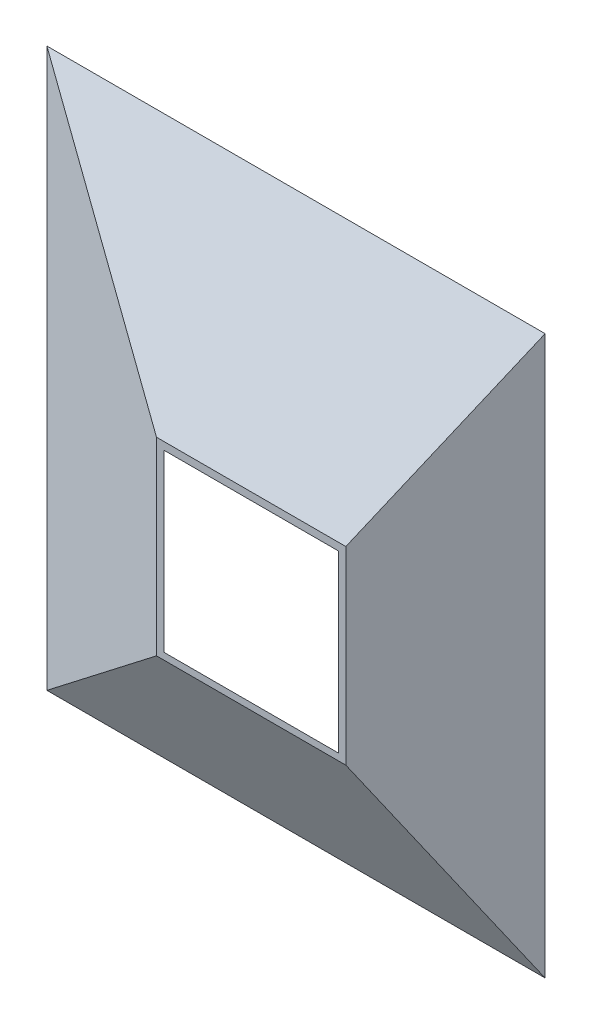
ISO-10303-21;
HEADER;
FILE_DESCRIPTION(('STEP AP214'),'2;1');
FILE_NAME('part.step','',(''),(''),'','','');
FILE_SCHEMA(('AUTOMOTIVE_DESIGN { 1 0 10303 214 1 1 1 1 }'));
ENDSEC;
DATA;
#1=APPLICATION_CONTEXT('core data for automotive mechanical design processes');
#2=APPLICATION_PROTOCOL_DEFINITION('international standard','automotive_design',2000,#1);
#3=PRODUCT_CONTEXT('',#1,'mechanical');
#4=PRODUCT('Part','Part','',(#3));
#5=PRODUCT_RELATED_PRODUCT_CATEGORY('part','',(#4));
#6=PRODUCT_DEFINITION_FORMATION('','',#4);
#7=PRODUCT_DEFINITION_CONTEXT('part definition',#1,'design');
#8=PRODUCT_DEFINITION('design','',#6,#7);
#9=PRODUCT_DEFINITION_SHAPE('','',#8);
#10=(LENGTH_UNIT() NAMED_UNIT(*) SI_UNIT(.MILLI.,.METRE.));
#11=(NAMED_UNIT(*) PLANE_ANGLE_UNIT() SI_UNIT($,.RADIAN.));
#12=(NAMED_UNIT(*) SI_UNIT($,.STERADIAN.) SOLID_ANGLE_UNIT());
#13=UNCERTAINTY_MEASURE_WITH_UNIT(LENGTH_MEASURE(1.E-05),#10,'distance_accuracy_value','');
#14=(GEOMETRIC_REPRESENTATION_CONTEXT(3) GLOBAL_UNCERTAINTY_ASSIGNED_CONTEXT((#13)) GLOBAL_UNIT_ASSIGNED_CONTEXT((#10,
#11,#12)) REPRESENTATION_CONTEXT('',''));
#15=CARTESIAN_POINT('',(0.,0.,0.));
#16=DIRECTION('',(0.,0.,1.));
#17=DIRECTION('',(1.,0.,0.));
#18=AXIS2_PLACEMENT_3D('',#15,#16,#17);
#19=CARTESIAN_POINT('',(0.,0.,100.));
#20=DIRECTION('',(0.,0.,-1.));
#21=DIRECTION('',(-1.,0.,0.));
#22=AXIS2_PLACEMENT_3D('',#19,#20,#21);
#23=PLANE('',#22);
#24=DIRECTION('',(0.,-1.,0.));
#25=VECTOR('',#24,1.);
#26=CARTESIAN_POINT('',(-40.,280.,100.));
#27=LINE('',#26,#25);
#28=CARTESIAN_POINT('',(-39.9999999999999,95.,100.));
#29=VERTEX_POINT('',#28);
#30=CARTESIAN_POINT('',(-40.,-94.9999999999999,100.));
#31=VERTEX_POINT('',#30);
#32=EDGE_CURVE('E200',#29,#31,#27,.T.);
#33=ORIENTED_EDGE('',*,*,#32,.T.);
#34=DIRECTION('',(-1.,0.,0.));
#35=VECTOR('',#34,1.);
#36=CARTESIAN_POINT('',(310.,-95.,100.));
#37=LINE('',#36,#35);
#38=CARTESIAN_POINT('',(150.,-95.,100.));
#39=VERTEX_POINT('',#38);
#40=EDGE_CURVE('E338',#39,#31,#37,.T.);
#41=ORIENTED_EDGE('',*,*,#40,.F.);
#42=DIRECTION('',(0.,1.,0.));
#43=VECTOR('',#42,1.);
#44=CARTESIAN_POINT('',(150.,-280.,100.));
#45=LINE('',#44,#43);
#46=CARTESIAN_POINT('',(150.,95.,100.));
#47=VERTEX_POINT('',#46);
#48=EDGE_CURVE('E348',#39,#47,#45,.T.);
#49=ORIENTED_EDGE('',*,*,#48,.T.);
#50=DIRECTION('',(-1.,0.,0.));
#51=VECTOR('',#50,1.);
#52=CARTESIAN_POINT('',(310.,95.,100.));
#53=LINE('',#52,#51);
#54=EDGE_CURVE('E343',#47,#29,#53,.T.);
#55=ORIENTED_EDGE('',*,*,#54,.T.);
#56=EDGE_LOOP('',(#33,#41,#49,#55));
#57=FACE_BOUND('',#56,.T.);
#58=DIRECTION('',(-1.,0.,0.));
#59=VECTOR('',#58,1.);
#60=CARTESIAN_POINT('',(142.44134744102,87.4212328739052,100.));
#61=LINE('',#60,#59);
#62=CARTESIAN_POINT('',(142.44134744102,87.4212328739052,100.));
#63=VERTEX_POINT('',#62);
#64=CARTESIAN_POINT('',(-32.4199058178358,87.4212328739052,100.));
#65=VERTEX_POINT('',#64);
#66=EDGE_CURVE('E120',#63,#65,#61,.T.);
#67=ORIENTED_EDGE('',*,*,#66,.F.);
#68=DIRECTION('',(0.,1.,0.));
#69=VECTOR('',#68,1.);
#70=CARTESIAN_POINT('',(142.44134744102,87.4212328739052,100.));
#71=LINE('',#70,#69);
#72=CARTESIAN_POINT('',(142.44134744102,-88.1825310144982,100.));
#73=VERTEX_POINT('',#72);
#74=EDGE_CURVE('E192',#73,#63,#71,.T.);
#75=ORIENTED_EDGE('',*,*,#74,.F.);
#76=DIRECTION('',(1.,0.,0.));
#77=VECTOR('',#76,1.);
#78=CARTESIAN_POINT('',(142.44134744102,-88.1825310144982,100.));
#79=LINE('',#78,#77);
#80=CARTESIAN_POINT('',(-32.4199058178358,-88.1825310144982,100.));
#81=VERTEX_POINT('',#80);
#82=EDGE_CURVE('E158',#81,#73,#79,.T.);
#83=ORIENTED_EDGE('',*,*,#82,.F.);
#84=DIRECTION('',(0.,-1.,0.));
#85=VECTOR('',#84,1.);
#86=CARTESIAN_POINT('',(-32.4199058178358,87.4212328739052,100.));
#87=LINE('',#86,#85);
#88=EDGE_CURVE('E51',#65,#81,#87,.T.);
#89=ORIENTED_EDGE('',*,*,#88,.F.);
#90=EDGE_LOOP('',(#67,#75,#83,#89));
#91=FACE_BOUND('',#90,.T.);
#92=ADVANCED_FACE('F46',(#57,#91),#23,.F.);
#93=CARTESIAN_POINT('',(0.,0.,0.));
#94=DIRECTION('',(0.,0.,-1.));
#95=DIRECTION('',(-1.,0.,0.));
#96=AXIS2_PLACEMENT_3D('',#93,#94,#95);
#97=PLANE('',#96);
#98=DIRECTION('',(0.,1.,0.));
#99=VECTOR('',#98,1.);
#100=CARTESIAN_POINT('',(250.,-280.,0.));
#101=LINE('',#100,#99);
#102=CARTESIAN_POINT('',(250.,-280.,0.));
#103=VERTEX_POINT('',#102);
#104=CARTESIAN_POINT('',(250.,280.,0.));
#105=VERTEX_POINT('',#104);
#106=EDGE_CURVE('E352',#103,#105,#101,.T.);
#107=ORIENTED_EDGE('',*,*,#106,.F.);
#108=DIRECTION('',(1.,0.,0.));
#109=VECTOR('',#108,1.);
#110=CARTESIAN_POINT('',(-250.,-280.,0.));
#111=LINE('',#110,#109);
#112=CARTESIAN_POINT('',(-250.,-280.,0.));
#113=VERTEX_POINT('',#112);
#114=EDGE_CURVE('E359',#113,#103,#111,.T.);
#115=ORIENTED_EDGE('',*,*,#114,.F.);
#116=DIRECTION('',(0.,-1.,0.));
#117=VECTOR('',#116,1.);
#118=CARTESIAN_POINT('',(-250.,-280.,0.));
#119=LINE('',#118,#117);
#120=CARTESIAN_POINT('',(-250.,280.,0.));
#121=VERTEX_POINT('',#120);
#122=EDGE_CURVE('E334',#121,#113,#119,.T.);
#123=ORIENTED_EDGE('',*,*,#122,.F.);
#124=DIRECTION('',(-1.,0.,0.));
#125=VECTOR('',#124,1.);
#126=CARTESIAN_POINT('',(-250.,280.,0.));
#127=LINE('',#126,#125);
#128=EDGE_CURVE('E355',#105,#121,#127,.T.);
#129=ORIENTED_EDGE('',*,*,#128,.F.);
#130=EDGE_LOOP('',(#107,#115,#123,#129));
#131=FACE_BOUND('',#130,.T.);
#132=DIRECTION('',(0.,-1.,0.));
#133=VECTOR('',#132,1.);
#134=CARTESIAN_POINT('',(241.18884501592,269.660255485912,0.));
#135=LINE('',#134,#133);
#136=CARTESIAN_POINT('',(241.18884501592,269.660255485912,0.));
#137=VERTEX_POINT('',#136);
#138=CARTESIAN_POINT('',(241.18884501592,-264.424134020165,0.));
#139=VERTEX_POINT('',#138);
#140=EDGE_CURVE('E139',#137,#139,#135,.T.);
#141=ORIENTED_EDGE('',*,*,#140,.F.);
#142=DIRECTION('',(1.,0.,0.));
#143=VECTOR('',#142,1.);
#144=CARTESIAN_POINT('',(-235.298208366956,269.660255485912,0.));
#145=LINE('',#144,#143);
#146=CARTESIAN_POINT('',(-235.298208366956,269.660255485912,0.));
#147=VERTEX_POINT('',#146);
#148=EDGE_CURVE('E116',#147,#137,#145,.T.);
#149=ORIENTED_EDGE('',*,*,#148,.F.);
#150=DIRECTION('',(0.,1.,0.));
#151=VECTOR('',#150,1.);
#152=CARTESIAN_POINT('',(-235.298208366956,269.660255485912,0.));
#153=LINE('',#152,#151);
#154=CARTESIAN_POINT('',(-235.298208366956,-264.424134020165,0.));
#155=VERTEX_POINT('',#154);
#156=EDGE_CURVE('E127',#155,#147,#153,.T.);
#157=ORIENTED_EDGE('',*,*,#156,.F.);
#158=DIRECTION('',(-1.,0.,0.));
#159=VECTOR('',#158,1.);
#160=CARTESIAN_POINT('',(-235.298208366956,-264.424134020165,0.));
#161=LINE('',#160,#159);
#162=EDGE_CURVE('E133',#139,#155,#161,.T.);
#163=ORIENTED_EDGE('',*,*,#162,.F.);
#164=EDGE_LOOP('',(#141,#149,#157,#163));
#165=FACE_BOUND('',#164,.T.);
#166=ADVANCED_FACE('F48',(#131,#165),#97,.T.);
#167=CARTESIAN_POINT('',(310.,-95.,100.));
#168=DIRECTION('',(0.,0.475517034365474,-0.879706513576127));
#169=DIRECTION('',(0.,0.879706513576127,0.475517034365474));
#170=AXIS2_PLACEMENT_3D('',#167,#168,#169);
#171=PLANE('',#170);
#172=DIRECTION('',(0.706606245425384,0.622486454303314,0.336479164488278));
#173=VECTOR('',#172,1.);
#174=CARTESIAN_POINT('',(134.752335125955,58.9484857061987,183.215397679026));
#175=LINE('',#174,#173);
#176=EDGE_CURVE('E202',#113,#31,#175,.T.);
#177=ORIENTED_EDGE('',*,*,#176,.F.);
#178=ORIENTED_EDGE('',*,*,#114,.T.);
#179=DIRECTION('',(0.429437750933887,-0.794459839227691,-0.429437750933887));
#180=VECTOR('',#179,1.);
#181=CARTESIAN_POINT('',(213.116643614569,-211.765790686953,36.8833563854311));
#182=LINE('',#181,#180);
#183=EDGE_CURVE('E346',#39,#103,#182,.T.);
#184=ORIENTED_EDGE('',*,*,#183,.F.);
#185=ORIENTED_EDGE('',*,*,#40,.T.);
#186=EDGE_LOOP('',(#177,#178,#184,#185));
#187=FACE_BOUND('',#186,.T.);
#188=ADVANCED_FACE('F344',(#187),#171,.F.);
#189=CARTESIAN_POINT('',(310.,95.,100.));
#190=DIRECTION('',(0.,-0.475517034365474,-0.879706513576127));
#191=DIRECTION('',(0.,0.879706513576127,-0.475517034365474));
#192=AXIS2_PLACEMENT_3D('',#189,#190,#191);
#193=PLANE('',#192);
#194=DIRECTION('',(-0.706606245425384,0.622486454303314,-0.336479164488278));
#195=VECTOR('',#194,1.);
#196=CARTESIAN_POINT('',(134.752335125955,-58.9484857061987,183.215397679026));
#197=LINE('',#196,#195);
#198=EDGE_CURVE('E12',#29,#121,#197,.T.);
#199=ORIENTED_EDGE('',*,*,#198,.F.);
#200=ORIENTED_EDGE('',*,*,#54,.F.);
#201=DIRECTION('',(-0.429437750933887,-0.794459839227691,0.429437750933887));
#202=VECTOR('',#201,1.);
#203=CARTESIAN_POINT('',(22.060857538036,-141.687413554633,227.939142461964));
#204=LINE('',#203,#202);
#205=EDGE_CURVE('E57',#105,#47,#204,.T.);
#206=ORIENTED_EDGE('',*,*,#205,.F.);
#207=ORIENTED_EDGE('',*,*,#128,.T.);
#208=EDGE_LOOP('',(#199,#200,#206,#207));
#209=FACE_BOUND('',#208,.T.);
#210=ADVANCED_FACE('F329',(#209),#193,.F.);
#211=CARTESIAN_POINT('',(150.,-280.,100.));
#212=DIRECTION('',(-0.707106781186548,0.,-0.707106781186548));
#213=DIRECTION('',(-0.707106781186548,0.,0.707106781186548));
#214=AXIS2_PLACEMENT_3D('',#211,#212,#213);
#215=PLANE('',#214);
#216=ORIENTED_EDGE('',*,*,#106,.T.);
#217=ORIENTED_EDGE('',*,*,#205,.T.);
#218=ORIENTED_EDGE('',*,*,#48,.F.);
#219=ORIENTED_EDGE('',*,*,#183,.T.);
#220=EDGE_LOOP('',(#216,#217,#218,#219));
#221=FACE_BOUND('',#220,.T.);
#222=ADVANCED_FACE('F172',(#221),#215,.F.);
#223=CARTESIAN_POINT('',(-40.,280.,100.));
#224=DIRECTION('',(-0.429933580392348,0.,0.90286051882393));
#225=DIRECTION('',(0.90286051882393,0.,0.429933580392348));
#226=AXIS2_PLACEMENT_3D('',#223,#224,#225);
#227=PLANE('',#226);
#228=ORIENTED_EDGE('',*,*,#176,.T.);
#229=ORIENTED_EDGE('',*,*,#32,.F.);
#230=ORIENTED_EDGE('',*,*,#198,.T.);
#231=ORIENTED_EDGE('',*,*,#122,.T.);
#232=EDGE_LOOP('',(#228,#229,#230,#231));
#233=FACE_BOUND('',#232,.T.);
#234=ADVANCED_FACE('F247',(#233),#227,.T.);
#235=CARTESIAN_POINT('',(0.,62.4053765361654,113.72694825685));
#236=DIRECTION('',(0.,-0.481063640079715,-0.876685675823014));
#237=DIRECTION('',(0.,0.876685675823014,-0.481063640079715));
#238=AXIS2_PLACEMENT_3D('',#235,#236,#237);
#239=PLANE('',#238);
#240=DIRECTION('',(0.69845730080494,-0.627401620752886,0.344274026364072));
#241=VECTOR('',#240,1.);
#242=CARTESIAN_POINT('',(-235.298208366956,269.660255485912,0.));
#243=LINE('',#242,#241);
#244=EDGE_CURVE('E112',#147,#65,#243,.T.);
#245=ORIENTED_EDGE('',*,*,#244,.F.);
#246=ORIENTED_EDGE('',*,*,#148,.T.);
#247=DIRECTION('',(-0.4290850454447,-0.791878692824177,0.434527513083801));
#248=VECTOR('',#247,1.);
#249=CARTESIAN_POINT('',(241.18884501592,269.660255485912,0.));
#250=LINE('',#249,#248);
#251=EDGE_CURVE('E124',#137,#63,#250,.T.);
#252=ORIENTED_EDGE('',*,*,#251,.T.);
#253=ORIENTED_EDGE('',*,*,#66,.T.);
#254=EDGE_LOOP('',(#245,#246,#252,#253));
#255=FACE_BOUND('',#254,.T.);
#256=ADVANCED_FACE('F114',(#255),#239,.T.);
#257=CARTESIAN_POINT('',(122.114329022425,0.,120.584844090025));
#258=DIRECTION('',(-0.711548823390624,0.,-0.702636657121886));
#259=DIRECTION('',(-0.702636657121886,0.,0.711548823390624));
#260=AXIS2_PLACEMENT_3D('',#257,#258,#259);
#261=PLANE('',#260);
#262=ORIENTED_EDGE('',*,*,#251,.F.);
#263=ORIENTED_EDGE('',*,*,#140,.T.);
#264=DIRECTION('',(-0.438068699652392,0.781852013969112,0.443625114975817));
#265=VECTOR('',#264,1.);
#266=CARTESIAN_POINT('',(241.18884501592,-264.424134020165,0.));
#267=LINE('',#266,#265);
#268=EDGE_CURVE('E70',#139,#73,#267,.T.);
#269=ORIENTED_EDGE('',*,*,#268,.T.);
#270=ORIENTED_EDGE('',*,*,#74,.T.);
#271=EDGE_LOOP('',(#262,#263,#269,#270));
#272=FACE_BOUND('',#271,.T.);
#273=ADVANCED_FACE('F264',(#272),#261,.T.);
#274=CARTESIAN_POINT('',(-45.9929675765544,0.,93.3097519112807));
#275=DIRECTION('',(0.442116176928824,0.,-0.896957795048263));
#276=DIRECTION('',(-0.896957795048263,0.,-0.442116176928824));
#277=AXIS2_PLACEMENT_3D('',#274,#275,#276);
#278=PLANE('',#277);
#279=DIRECTION('',(0.707530222571301,0.614635764564972,0.348746126954604));
#280=VECTOR('',#279,1.);
#281=CARTESIAN_POINT('',(-235.298208366956,-264.424134020165,0.));
#282=LINE('',#281,#280);
#283=EDGE_CURVE('E65',#155,#81,#282,.T.);
#284=ORIENTED_EDGE('',*,*,#283,.F.);
#285=ORIENTED_EDGE('',*,*,#156,.T.);
#286=ORIENTED_EDGE('',*,*,#244,.T.);
#287=ORIENTED_EDGE('',*,*,#88,.T.);
#288=EDGE_LOOP('',(#284,#285,#286,#287));
#289=FACE_BOUND('',#288,.T.);
#290=ADVANCED_FACE('F129',(#289),#278,.T.);
#291=CARTESIAN_POINT('',(0.,-64.3977187857898,113.495571887157));
#292=DIRECTION('',(0.,0.493497203803592,-0.869747382771593));
#293=DIRECTION('',(0.,0.869747382771593,0.493497203803592));
#294=AXIS2_PLACEMENT_3D('',#291,#292,#293);
#295=PLANE('',#294);
#296=ORIENTED_EDGE('',*,*,#268,.F.);
#297=ORIENTED_EDGE('',*,*,#162,.T.);
#298=ORIENTED_EDGE('',*,*,#283,.T.);
#299=ORIENTED_EDGE('',*,*,#82,.T.);
#300=EDGE_LOOP('',(#296,#297,#298,#299));
#301=FACE_BOUND('',#300,.T.);
#302=ADVANCED_FACE('F225',(#301),#295,.T.);
#303=CLOSED_SHELL('',(#92,#166,#188,#210,#222,#234,#256,#273,#290,#302));
#304=MANIFOLD_SOLID_BREP('B2',#303);
#305=ADVANCED_BREP_SHAPE_REPRESENTATION('',(#18,#304),#14);
#306=SHAPE_DEFINITION_REPRESENTATION(#9,#305);
ENDSEC;
END-ISO-10303-21;
